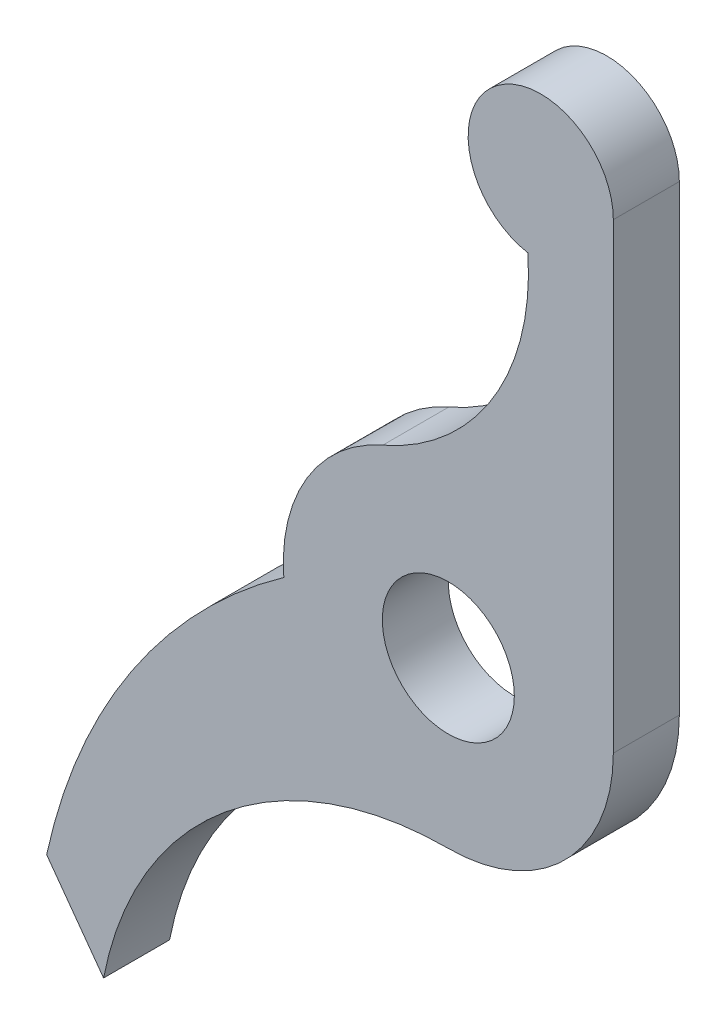
ISO-10303-21;
HEADER;
FILE_DESCRIPTION(('STEP AP214'),'2;1');
FILE_NAME('part.step','',(''),(''),'','','');
FILE_SCHEMA(('AUTOMOTIVE_DESIGN { 1 0 10303 214 1 1 1 1 }'));
ENDSEC;
DATA;
#1=APPLICATION_CONTEXT('core data for automotive mechanical design processes');
#2=APPLICATION_PROTOCOL_DEFINITION('international standard','automotive_design',2000,#1);
#3=PRODUCT_CONTEXT('',#1,'mechanical');
#4=PRODUCT('Part','Part','',(#3));
#5=PRODUCT_RELATED_PRODUCT_CATEGORY('part','',(#4));
#6=PRODUCT_DEFINITION_FORMATION('','',#4);
#7=PRODUCT_DEFINITION_CONTEXT('part definition',#1,'design');
#8=PRODUCT_DEFINITION('design','',#6,#7);
#9=PRODUCT_DEFINITION_SHAPE('','',#8);
#10=(LENGTH_UNIT() NAMED_UNIT(*) SI_UNIT(.MILLI.,.METRE.));
#11=(NAMED_UNIT(*) PLANE_ANGLE_UNIT() SI_UNIT($,.RADIAN.));
#12=(NAMED_UNIT(*) SI_UNIT($,.STERADIAN.) SOLID_ANGLE_UNIT());
#13=UNCERTAINTY_MEASURE_WITH_UNIT(LENGTH_MEASURE(1.E-05),#10,'distance_accuracy_value','');
#14=(GEOMETRIC_REPRESENTATION_CONTEXT(3) GLOBAL_UNCERTAINTY_ASSIGNED_CONTEXT((#13)) GLOBAL_UNIT_ASSIGNED_CONTEXT((#10,
#11,#12)) REPRESENTATION_CONTEXT('',''));
#15=CARTESIAN_POINT('',(0.,0.,0.));
#16=DIRECTION('',(0.,0.,1.));
#17=DIRECTION('',(1.,0.,0.));
#18=AXIS2_PLACEMENT_3D('',#15,#16,#17);
#19=CARTESIAN_POINT('',(0.,-80.5,-2.));
#20=DIRECTION('',(0.,0.,1.));
#21=DIRECTION('',(1.,0.,0.));
#22=AXIS2_PLACEMENT_3D('',#19,#20,#21);
#23=CYLINDRICAL_SURFACE('',#22,5.);
#24=CARTESIAN_POINT('',(0.,-80.5,0.));
#25=DIRECTION('',(0.,0.,1.));
#26=DIRECTION('',(1.,0.,0.));
#27=AXIS2_PLACEMENT_3D('',#24,#25,#26);
#28=CIRCLE('',#27,5.);
#29=CARTESIAN_POINT('',(0.,-85.5,0.));
#30=VERTEX_POINT('',#29);
#31=CARTESIAN_POINT('',(5.00000000000002,-80.5,0.));
#32=VERTEX_POINT('',#31);
#33=EDGE_CURVE('E131',#30,#32,#28,.T.);
#34=ORIENTED_EDGE('',*,*,#33,.F.);
#35=DIRECTION('',(0.,0.,1.));
#36=VECTOR('',#35,1.);
#37=CARTESIAN_POINT('',(0.,-85.5,-2.));
#38=LINE('',#37,#36);
#39=CARTESIAN_POINT('',(0.,-85.5,-2.));
#40=VERTEX_POINT('',#39);
#41=EDGE_CURVE('E11',#40,#30,#38,.T.);
#42=ORIENTED_EDGE('',*,*,#41,.F.);
#43=CARTESIAN_POINT('',(0.,-80.5,-2.));
#44=DIRECTION('',(0.,0.,1.));
#45=DIRECTION('',(1.,0.,0.));
#46=AXIS2_PLACEMENT_3D('',#43,#44,#45);
#47=CIRCLE('',#46,5.);
#48=CARTESIAN_POINT('',(5.00000000000002,-80.5,-2.));
#49=VERTEX_POINT('',#48);
#50=EDGE_CURVE('E152',#40,#49,#47,.T.);
#51=ORIENTED_EDGE('',*,*,#50,.T.);
#52=DIRECTION('',(0.,0.,1.));
#53=VECTOR('',#52,1.);
#54=CARTESIAN_POINT('',(5.00000000000002,-80.5,-2.));
#55=LINE('',#54,#53);
#56=EDGE_CURVE('E37',#49,#32,#55,.T.);
#57=ORIENTED_EDGE('',*,*,#56,.T.);
#58=EDGE_LOOP('',(#34,#42,#51,#57));
#59=FACE_BOUND('',#58,.T.);
#60=ADVANCED_FACE('F34',(#59),#23,.T.);
#61=CARTESIAN_POINT('',(0.,-96.1383126298514,-2.));
#62=DIRECTION('',(0.,0.,1.));
#63=DIRECTION('',(1.,0.,0.));
#64=AXIS2_PLACEMENT_3D('',#61,#62,#63);
#65=CYLINDRICAL_SURFACE('',#64,10.6383126298514);
#66=CARTESIAN_POINT('',(0.,-96.1383126298514,0.));
#67=DIRECTION('',(0.,0.,-1.));
#68=DIRECTION('',(1.,0.,0.));
#69=AXIS2_PLACEMENT_3D('',#66,#67,#68);
#70=CIRCLE('',#69,10.6383126298514);
#71=CARTESIAN_POINT('',(-10.4456418749818,-94.1228073755585,0.));
#72=VERTEX_POINT('',#71);
#73=EDGE_CURVE('E150',#72,#30,#70,.T.);
#74=ORIENTED_EDGE('',*,*,#73,.F.);
#75=DIRECTION('',(0.,0.,1.));
#76=VECTOR('',#75,1.);
#77=CARTESIAN_POINT('',(-10.4456418749818,-94.1228073755585,-2.));
#78=LINE('',#77,#76);
#79=CARTESIAN_POINT('',(-10.4456418749818,-94.1228073755585,-2.));
#80=VERTEX_POINT('',#79);
#81=EDGE_CURVE('E43',#80,#72,#78,.T.);
#82=ORIENTED_EDGE('',*,*,#81,.F.);
#83=CARTESIAN_POINT('',(0.,-96.1383126298514,-2.));
#84=DIRECTION('',(0.,0.,-1.));
#85=DIRECTION('',(1.,0.,0.));
#86=AXIS2_PLACEMENT_3D('',#83,#84,#85);
#87=CIRCLE('',#86,10.6383126298514);
#88=EDGE_CURVE('E121',#80,#40,#87,.T.);
#89=ORIENTED_EDGE('',*,*,#88,.T.);
#90=ORIENTED_EDGE('',*,*,#41,.T.);
#91=EDGE_LOOP('',(#74,#82,#89,#90));
#92=FACE_BOUND('',#91,.T.);
#93=ADVANCED_FACE('F164',(#92),#65,.F.);
#94=CARTESIAN_POINT('',(-10.4456418749818,-94.1228073755585,-2.));
#95=DIRECTION('',(-0.809016994374948,-0.587785252292473,0.));
#96=DIRECTION('',(0.587785252292473,-0.809016994374948,0.));
#97=AXIS2_PLACEMENT_3D('',#94,#95,#96);
#98=PLANE('',#97);
#99=DIRECTION('',(0.587785252292473,-0.809016994374948,0.));
#100=VECTOR('',#99,1.);
#101=CARTESIAN_POINT('',(-10.4456418749818,-94.1228073755585,0.));
#102=LINE('',#101,#100);
#103=CARTESIAN_POINT('',(-12.1706497799544,-91.7485376824843,0.));
#104=VERTEX_POINT('',#103);
#105=EDGE_CURVE('E108',#104,#72,#102,.T.);
#106=ORIENTED_EDGE('',*,*,#105,.F.);
#107=DIRECTION('',(0.,0.,1.));
#108=VECTOR('',#107,1.);
#109=CARTESIAN_POINT('',(-12.1706497799544,-91.7485376824843,-2.));
#110=LINE('',#109,#108);
#111=CARTESIAN_POINT('',(-12.1706497799544,-91.7485376824843,-2.));
#112=VERTEX_POINT('',#111);
#113=EDGE_CURVE('E103',#112,#104,#110,.T.);
#114=ORIENTED_EDGE('',*,*,#113,.F.);
#115=DIRECTION('',(0.587785252292473,-0.809016994374948,0.));
#116=VECTOR('',#115,1.);
#117=CARTESIAN_POINT('',(-10.4456418749818,-94.1228073755585,-2.));
#118=LINE('',#117,#116);
#119=EDGE_CURVE('E106',#112,#80,#118,.T.);
#120=ORIENTED_EDGE('',*,*,#119,.T.);
#121=ORIENTED_EDGE('',*,*,#81,.T.);
#122=EDGE_LOOP('',(#106,#114,#120,#121));
#123=FACE_BOUND('',#122,.T.);
#124=ADVANCED_FACE('F105',(#123),#98,.T.);
#125=CARTESIAN_POINT('',(5.41889690065829,-95.5705590809785,-2.));
#126=DIRECTION('',(0.,0.,1.));
#127=DIRECTION('',(1.,0.,0.));
#128=AXIS2_PLACEMENT_3D('',#125,#126,#127);
#129=CYLINDRICAL_SURFACE('',#128,18.);
#130=CARTESIAN_POINT('',(5.41889690065829,-95.5705590809785,0.));
#131=DIRECTION('',(0.,0.,1.));
#132=DIRECTION('',(-1.,0.,0.));
#133=AXIS2_PLACEMENT_3D('',#130,#131,#132);
#134=CIRCLE('',#133,18.);
#135=CARTESIAN_POINT('',(-4.98537912863786,-80.8820928470174,0.));
#136=VERTEX_POINT('',#135);
#137=EDGE_CURVE('E147',#136,#104,#134,.T.);
#138=ORIENTED_EDGE('',*,*,#137,.F.);
#139=DIRECTION('',(0.,0.,1.));
#140=VECTOR('',#139,1.);
#141=CARTESIAN_POINT('',(-4.98537912863786,-80.8820928470174,-2.));
#142=LINE('',#141,#140);
#143=CARTESIAN_POINT('',(-4.98537912863786,-80.8820928470174,-2.));
#144=VERTEX_POINT('',#143);
#145=EDGE_CURVE('E113',#144,#136,#142,.T.);
#146=ORIENTED_EDGE('',*,*,#145,.F.);
#147=CARTESIAN_POINT('',(5.41889690065829,-95.5705590809785,-2.));
#148=DIRECTION('',(0.,0.,1.));
#149=DIRECTION('',(-1.,0.,0.));
#150=AXIS2_PLACEMENT_3D('',#147,#148,#149);
#151=CIRCLE('',#150,18.);
#152=EDGE_CURVE('E119',#144,#112,#151,.T.);
#153=ORIENTED_EDGE('',*,*,#152,.T.);
#154=ORIENTED_EDGE('',*,*,#113,.T.);
#155=EDGE_LOOP('',(#138,#146,#153,#154));
#156=FACE_BOUND('',#155,.T.);
#157=ADVANCED_FACE('F123',(#156),#129,.T.);
#158=CARTESIAN_POINT('',(0.,-80.5,-2.));
#159=DIRECTION('',(0.,0.,1.));
#160=DIRECTION('',(1.,0.,0.));
#161=AXIS2_PLACEMENT_3D('',#158,#159,#160);
#162=CYLINDRICAL_SURFACE('',#161,5.);
#163=CARTESIAN_POINT('',(0.,-80.5,0.));
#164=DIRECTION('',(0.,0.,1.));
#165=DIRECTION('',(1.,0.,0.));
#166=AXIS2_PLACEMENT_3D('',#163,#164,#165);
#167=CIRCLE('',#166,5.);
#168=CARTESIAN_POINT('',(-1.98859594365554,-75.9124640412443,0.));
#169=VERTEX_POINT('',#168);
#170=EDGE_CURVE('E144',#169,#136,#167,.T.);
#171=ORIENTED_EDGE('',*,*,#170,.F.);
#172=DIRECTION('',(0.,0.,1.));
#173=VECTOR('',#172,1.);
#174=CARTESIAN_POINT('',(-1.98859594365554,-75.9124640412443,-2.));
#175=LINE('',#174,#173);
#176=CARTESIAN_POINT('',(-1.98859594365554,-75.9124640412443,-2.));
#177=VERTEX_POINT('',#176);
#178=EDGE_CURVE('E156',#177,#169,#175,.T.);
#179=ORIENTED_EDGE('',*,*,#178,.F.);
#180=CARTESIAN_POINT('',(0.,-80.5,-2.));
#181=DIRECTION('',(0.,0.,1.));
#182=DIRECTION('',(1.,0.,0.));
#183=AXIS2_PLACEMENT_3D('',#180,#181,#182);
#184=CIRCLE('',#183,5.);
#185=EDGE_CURVE('E124',#177,#144,#184,.T.);
#186=ORIENTED_EDGE('',*,*,#185,.T.);
#187=ORIENTED_EDGE('',*,*,#145,.T.);
#188=EDGE_LOOP('',(#171,#179,#186,#187));
#189=FACE_BOUND('',#188,.T.);
#190=ADVANCED_FACE('F177',(#189),#162,.T.);
#191=CARTESIAN_POINT('',(-4.90546393702441,-69.1834767629512,-2.));
#192=DIRECTION('',(0.,0.,1.));
#193=DIRECTION('',(1.,0.,0.));
#194=AXIS2_PLACEMENT_3D('',#191,#192,#193);
#195=CYLINDRICAL_SURFACE('',#194,7.33398859299422);
#196=CARTESIAN_POINT('',(-4.90546393702441,-69.1834767629512,0.));
#197=DIRECTION('',(0.,0.,-1.));
#198=DIRECTION('',(-1.,0.,0.));
#199=AXIS2_PLACEMENT_3D('',#196,#197,#198);
#200=CIRCLE('',#199,7.33398859299422);
#201=CARTESIAN_POINT('',(2.4101882754642,-68.6651897883129,0.));
#202=VERTEX_POINT('',#201);
#203=EDGE_CURVE('E141',#202,#169,#200,.T.);
#204=ORIENTED_EDGE('',*,*,#203,.F.);
#205=DIRECTION('',(0.,0.,1.));
#206=VECTOR('',#205,1.);
#207=CARTESIAN_POINT('',(2.4101882754642,-68.6651897883129,-2.));
#208=LINE('',#207,#206);
#209=CARTESIAN_POINT('',(2.4101882754642,-68.6651897883129,-2.));
#210=VERTEX_POINT('',#209);
#211=EDGE_CURVE('E158',#210,#202,#208,.T.);
#212=ORIENTED_EDGE('',*,*,#211,.F.);
#213=CARTESIAN_POINT('',(-4.90546393702441,-69.1834767629512,-2.));
#214=DIRECTION('',(0.,0.,-1.));
#215=DIRECTION('',(-1.,0.,0.));
#216=AXIS2_PLACEMENT_3D('',#213,#214,#215);
#217=CIRCLE('',#216,7.33398859299422);
#218=EDGE_CURVE('E126',#210,#177,#217,.T.);
#219=ORIENTED_EDGE('',*,*,#218,.T.);
#220=ORIENTED_EDGE('',*,*,#178,.T.);
#221=EDGE_LOOP('',(#204,#212,#219,#220));
#222=FACE_BOUND('',#221,.T.);
#223=ADVANCED_FACE('F180',(#222),#195,.F.);
#224=CARTESIAN_POINT('',(2.8,-66.5,-2.));
#225=DIRECTION('',(0.,0.,1.));
#226=DIRECTION('',(1.,0.,0.));
#227=AXIS2_PLACEMENT_3D('',#224,#225,#226);
#228=CYLINDRICAL_SURFACE('',#227,2.20000000000002);
#229=CARTESIAN_POINT('',(2.8,-66.5,0.));
#230=DIRECTION('',(0.,0.,1.));
#231=DIRECTION('',(1.,0.,0.));
#232=AXIS2_PLACEMENT_3D('',#229,#230,#231);
#233=CIRCLE('',#232,2.20000000000002);
#234=CARTESIAN_POINT('',(5.00000000000002,-66.5,0.));
#235=VERTEX_POINT('',#234);
#236=EDGE_CURVE('E138',#235,#202,#233,.T.);
#237=ORIENTED_EDGE('',*,*,#236,.F.);
#238=DIRECTION('',(0.,0.,1.));
#239=VECTOR('',#238,1.);
#240=CARTESIAN_POINT('',(5.00000000000002,-66.5,-2.));
#241=LINE('',#240,#239);
#242=CARTESIAN_POINT('',(5.00000000000002,-66.5,-2.));
#243=VERTEX_POINT('',#242);
#244=EDGE_CURVE('E159',#243,#235,#241,.T.);
#245=ORIENTED_EDGE('',*,*,#244,.F.);
#246=CARTESIAN_POINT('',(2.8,-66.5,-2.));
#247=DIRECTION('',(0.,0.,1.));
#248=DIRECTION('',(1.,0.,0.));
#249=AXIS2_PLACEMENT_3D('',#246,#247,#248);
#250=CIRCLE('',#249,2.20000000000002);
#251=EDGE_CURVE('E215',#243,#210,#250,.T.);
#252=ORIENTED_EDGE('',*,*,#251,.T.);
#253=ORIENTED_EDGE('',*,*,#211,.T.);
#254=EDGE_LOOP('',(#237,#245,#252,#253));
#255=FACE_BOUND('',#254,.T.);
#256=ADVANCED_FACE('F184',(#255),#228,.T.);
#257=CARTESIAN_POINT('',(5.00000000000002,-66.5,-2.));
#258=DIRECTION('',(1.,0.,0.));
#259=DIRECTION('',(0.,1.,0.));
#260=AXIS2_PLACEMENT_3D('',#257,#258,#259);
#261=PLANE('',#260);
#262=DIRECTION('',(0.,1.,0.));
#263=VECTOR('',#262,1.);
#264=CARTESIAN_POINT('',(5.00000000000002,-66.5,0.));
#265=LINE('',#264,#263);
#266=EDGE_CURVE('E134',#32,#235,#265,.T.);
#267=ORIENTED_EDGE('',*,*,#266,.F.);
#268=ORIENTED_EDGE('',*,*,#56,.F.);
#269=DIRECTION('',(0.,1.,0.));
#270=VECTOR('',#269,1.);
#271=CARTESIAN_POINT('',(5.00000000000002,-66.5,-2.));
#272=LINE('',#271,#270);
#273=EDGE_CURVE('E213',#49,#243,#272,.T.);
#274=ORIENTED_EDGE('',*,*,#273,.T.);
#275=ORIENTED_EDGE('',*,*,#244,.T.);
#276=EDGE_LOOP('',(#267,#268,#274,#275));
#277=FACE_BOUND('',#276,.T.);
#278=ADVANCED_FACE('F161',(#277),#261,.T.);
#279=CARTESIAN_POINT('',(0.,-80.5,-2.));
#280=DIRECTION('',(0.,0.,1.));
#281=DIRECTION('',(1.,0.,0.));
#282=AXIS2_PLACEMENT_3D('',#279,#280,#281);
#283=PLANE('',#282);
#284=CARTESIAN_POINT('',(0.,-80.5,-2.));
#285=DIRECTION('',(0.,0.,1.));
#286=DIRECTION('',(1.,0.,0.));
#287=AXIS2_PLACEMENT_3D('',#284,#285,#286);
#288=CIRCLE('',#287,2.);
#289=CARTESIAN_POINT('',(2.00000000000001,-80.5,-2.));
#290=VERTEX_POINT('',#289);
#291=EDGE_CURVE('E135',#290,#290,#288,.T.);
#292=ORIENTED_EDGE('',*,*,#291,.T.);
#293=EDGE_LOOP('',(#292));
#294=FACE_BOUND('',#293,.T.);
#295=ORIENTED_EDGE('',*,*,#50,.F.);
#296=ORIENTED_EDGE('',*,*,#88,.F.);
#297=ORIENTED_EDGE('',*,*,#119,.F.);
#298=ORIENTED_EDGE('',*,*,#152,.F.);
#299=ORIENTED_EDGE('',*,*,#185,.F.);
#300=ORIENTED_EDGE('',*,*,#218,.F.);
#301=ORIENTED_EDGE('',*,*,#251,.F.);
#302=ORIENTED_EDGE('',*,*,#273,.F.);
#303=EDGE_LOOP('',(#295,#296,#297,#298,#299,#300,#301,#302));
#304=FACE_BOUND('',#303,.T.);
#305=ADVANCED_FACE('F117',(#294,#304),#283,.F.);
#306=CARTESIAN_POINT('',(0.,-80.5,0.));
#307=DIRECTION('',(0.,0.,1.));
#308=DIRECTION('',(1.,0.,0.));
#309=AXIS2_PLACEMENT_3D('',#306,#307,#308);
#310=PLANE('',#309);
#311=CARTESIAN_POINT('',(0.,-80.5,0.));
#312=DIRECTION('',(0.,0.,1.));
#313=DIRECTION('',(1.,0.,0.));
#314=AXIS2_PLACEMENT_3D('',#311,#312,#313);
#315=CIRCLE('',#314,2.);
#316=CARTESIAN_POINT('',(2.00000000000001,-80.5,0.));
#317=VERTEX_POINT('',#316);
#318=EDGE_CURVE('E208',#317,#317,#315,.T.);
#319=ORIENTED_EDGE('',*,*,#318,.F.);
#320=EDGE_LOOP('',(#319));
#321=FACE_BOUND('',#320,.T.);
#322=ORIENTED_EDGE('',*,*,#33,.T.);
#323=ORIENTED_EDGE('',*,*,#266,.T.);
#324=ORIENTED_EDGE('',*,*,#236,.T.);
#325=ORIENTED_EDGE('',*,*,#203,.T.);
#326=ORIENTED_EDGE('',*,*,#170,.T.);
#327=ORIENTED_EDGE('',*,*,#137,.T.);
#328=ORIENTED_EDGE('',*,*,#105,.T.);
#329=ORIENTED_EDGE('',*,*,#73,.T.);
#330=EDGE_LOOP('',(#322,#323,#324,#325,#326,#327,#328,#329));
#331=FACE_BOUND('',#330,.T.);
#332=ADVANCED_FACE('F163',(#321,#331),#310,.T.);
#333=CARTESIAN_POINT('',(0.,-80.5,-2.));
#334=DIRECTION('',(0.,0.,1.));
#335=DIRECTION('',(1.,0.,0.));
#336=AXIS2_PLACEMENT_3D('',#333,#334,#335);
#337=CYLINDRICAL_SURFACE('',#336,2.);
#338=ORIENTED_EDGE('',*,*,#291,.F.);
#339=EDGE_LOOP('',(#338));
#340=FACE_BOUND('',#339,.T.);
#341=ORIENTED_EDGE('',*,*,#318,.T.);
#342=EDGE_LOOP('',(#341));
#343=FACE_BOUND('',#342,.T.);
#344=ADVANCED_FACE('F196',(#340,#343),#337,.F.);
#345=CLOSED_SHELL('',(#60,#93,#124,#157,#190,#223,#256,#278,#305,#332,#344));
#346=MANIFOLD_SOLID_BREP('B2',#345);
#347=ADVANCED_BREP_SHAPE_REPRESENTATION('',(#18,#346),#14);
#348=SHAPE_DEFINITION_REPRESENTATION(#9,#347);
ENDSEC;
END-ISO-10303-21;
